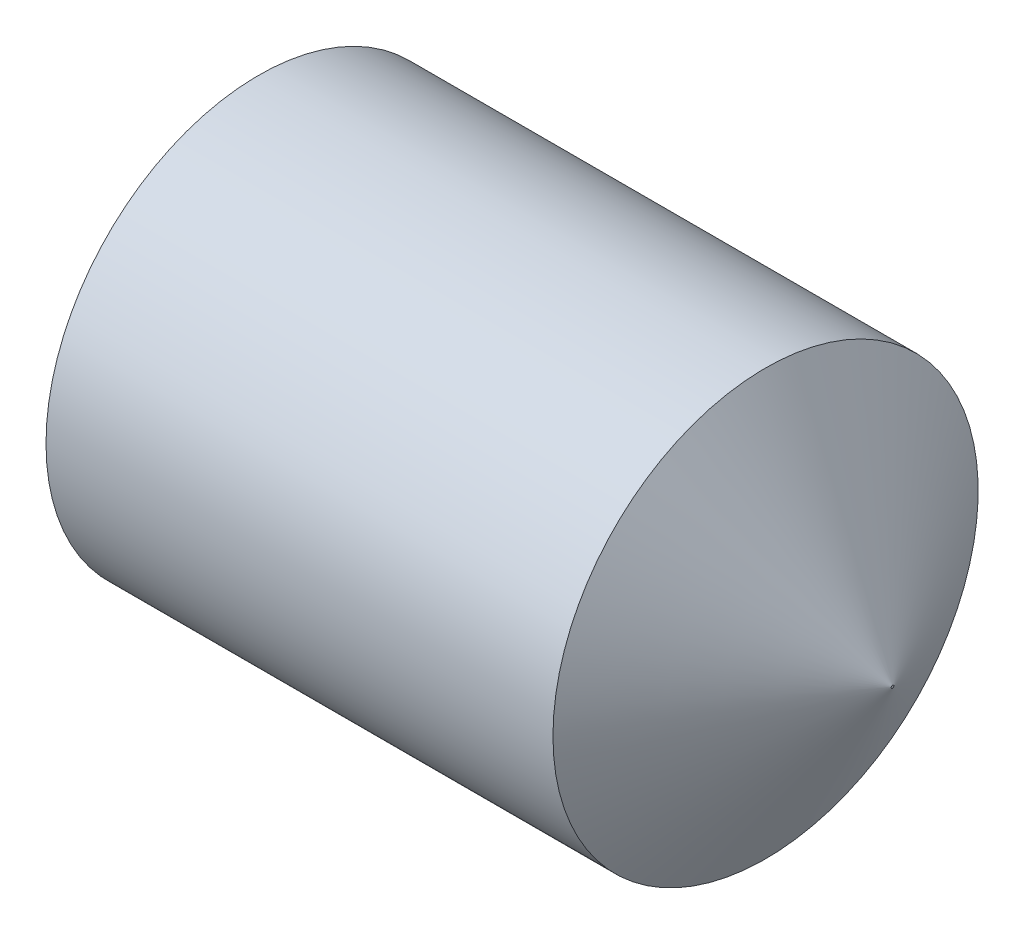
ISO-10303-21;
HEADER;
FILE_DESCRIPTION(('STEP AP214'),'2;1');
FILE_NAME('part.step','',(''),(''),'','','');
FILE_SCHEMA(('AUTOMOTIVE_DESIGN { 1 0 10303 214 1 1 1 1 }'));
ENDSEC;
DATA;
#1=APPLICATION_CONTEXT('core data for automotive mechanical design processes');
#2=APPLICATION_PROTOCOL_DEFINITION('international standard','automotive_design',2000,#1);
#3=PRODUCT_CONTEXT('',#1,'mechanical');
#4=PRODUCT('Part','Part','',(#3));
#5=PRODUCT_RELATED_PRODUCT_CATEGORY('part','',(#4));
#6=PRODUCT_DEFINITION_FORMATION('','',#4);
#7=PRODUCT_DEFINITION_CONTEXT('part definition',#1,'design');
#8=PRODUCT_DEFINITION('design','',#6,#7);
#9=PRODUCT_DEFINITION_SHAPE('','',#8);
#10=(LENGTH_UNIT() NAMED_UNIT(*) SI_UNIT(.MILLI.,.METRE.));
#11=(NAMED_UNIT(*) PLANE_ANGLE_UNIT() SI_UNIT($,.RADIAN.));
#12=(NAMED_UNIT(*) SI_UNIT($,.STERADIAN.) SOLID_ANGLE_UNIT());
#13=UNCERTAINTY_MEASURE_WITH_UNIT(LENGTH_MEASURE(1.E-05),#10,'distance_accuracy_value','');
#14=(GEOMETRIC_REPRESENTATION_CONTEXT(3) GLOBAL_UNCERTAINTY_ASSIGNED_CONTEXT((#13)) GLOBAL_UNIT_ASSIGNED_CONTEXT((#10,
#11,#12)) REPRESENTATION_CONTEXT('',''));
#15=CARTESIAN_POINT('',(0.,0.,0.));
#16=DIRECTION('',(0.,0.,1.));
#17=DIRECTION('',(1.,0.,0.));
#18=AXIS2_PLACEMENT_3D('',#15,#16,#17);
#19=CARTESIAN_POINT('',(0.,0.,0.));
#20=DIRECTION('',(-1.,0.,0.));
#21=DIRECTION('',(0.,0.,1.));
#22=AXIS2_PLACEMENT_3D('',#19,#20,#21);
#23=PLANE('',#22);
#24=CARTESIAN_POINT('',(0.,0.,0.));
#25=DIRECTION('',(-1.,0.,0.));
#26=DIRECTION('',(0.,0.,1.));
#27=AXIS2_PLACEMENT_3D('',#24,#25,#26);
#28=CIRCLE('',#27,0.601000000000001);
#29=CARTESIAN_POINT('',(0.,0.,0.601000000000001));
#30=VERTEX_POINT('',#29);
#31=EDGE_CURVE('E11',#30,#30,#28,.T.);
#32=ORIENTED_EDGE('',*,*,#31,.T.);
#33=EDGE_LOOP('',(#32));
#34=FACE_BOUND('',#33,.T.);
#35=DIRECTION('',(0.,0.,-1.));
#36=VECTOR('',#35,1.);
#37=CARTESIAN_POINT('',(0.,0.350000000000003,0.202072594216366));
#38=LINE('',#37,#36);
#39=CARTESIAN_POINT('',(0.,0.350000000000003,0.202072594216366));
#40=VERTEX_POINT('',#39);
#41=CARTESIAN_POINT('',(0.,0.350000000000003,-0.202072594216372));
#42=VERTEX_POINT('',#41);
#43=EDGE_CURVE('E125',#40,#42,#38,.T.);
#44=ORIENTED_EDGE('',*,*,#43,.F.);
#45=DIRECTION('',(0.,-0.866025403784439,0.5));
#46=VECTOR('',#45,1.);
#47=CARTESIAN_POINT('',(0.,0.350000000000003,0.202072594216366));
#48=LINE('',#47,#46);
#49=CARTESIAN_POINT('',(0.,0.,0.404145188432735));
#50=VERTEX_POINT('',#49);
#51=EDGE_CURVE('E47',#40,#50,#48,.T.);
#52=ORIENTED_EDGE('',*,*,#51,.T.);
#53=DIRECTION('',(0.,0.866025403784439,0.5));
#54=VECTOR('',#53,1.);
#55=CARTESIAN_POINT('',(0.,-0.349999999999997,0.202072594216366));
#56=LINE('',#55,#54);
#57=CARTESIAN_POINT('',(0.,-0.349999999999997,0.202072594216366));
#58=VERTEX_POINT('',#57);
#59=EDGE_CURVE('E116',#58,#50,#56,.T.);
#60=ORIENTED_EDGE('',*,*,#59,.F.);
#61=DIRECTION('',(0.,0.,-1.));
#62=VECTOR('',#61,1.);
#63=CARTESIAN_POINT('',(0.,-0.349999999999997,0.202072594216366));
#64=LINE('',#63,#62);
#65=CARTESIAN_POINT('',(0.,-0.349999999999997,-0.202072594216372));
#66=VERTEX_POINT('',#65);
#67=EDGE_CURVE('E119',#58,#66,#64,.T.);
#68=ORIENTED_EDGE('',*,*,#67,.T.);
#69=DIRECTION('',(0.,0.866025403784439,-0.5));
#70=VECTOR('',#69,1.);
#71=CARTESIAN_POINT('',(0.,-0.349999999999997,-0.202072594216372));
#72=LINE('',#71,#70);
#73=CARTESIAN_POINT('',(0.,0.,-0.404145188432741));
#74=VERTEX_POINT('',#73);
#75=EDGE_CURVE('E122',#66,#74,#72,.T.);
#76=ORIENTED_EDGE('',*,*,#75,.T.);
#77=DIRECTION('',(0.,-0.866025403784439,-0.5));
#78=VECTOR('',#77,1.);
#79=CARTESIAN_POINT('',(0.,0.350000000000003,-0.202072594216372));
#80=LINE('',#79,#78);
#81=EDGE_CURVE('E105',#42,#74,#80,.T.);
#82=ORIENTED_EDGE('',*,*,#81,.F.);
#83=EDGE_LOOP('',(#44,#52,#60,#68,#76,#82));
#84=FACE_BOUND('',#83,.T.);
#85=ADVANCED_FACE('F33',(#34,#84),#23,.T.);
#86=CARTESIAN_POINT('',(0.,0.,0.));
#87=DIRECTION('',(1.,0.,0.));
#88=DIRECTION('',(0.,0.,-1.));
#89=AXIS2_PLACEMENT_3D('',#86,#87,#88);
#90=CONICAL_SURFACE('',#89,0.601000000000001,1.0471975511966);
#91=CARTESIAN_POINT('',(0.114892703568735,0.,0.));
#92=DIRECTION('',(-1.,0.,0.));
#93=DIRECTION('',(0.,0.,1.));
#94=AXIS2_PLACEMENT_3D('',#91,#92,#93);
#95=CIRCLE('',#94,0.8);
#96=CARTESIAN_POINT('',(0.114892703568735,0.,0.8));
#97=VERTEX_POINT('',#96);
#98=EDGE_CURVE('E40',#97,#97,#95,.T.);
#99=ORIENTED_EDGE('',*,*,#98,.T.);
#100=EDGE_LOOP('',(#99));
#101=FACE_BOUND('',#100,.T.);
#102=ORIENTED_EDGE('',*,*,#31,.F.);
#103=EDGE_LOOP('',(#102));
#104=FACE_BOUND('',#103,.T.);
#105=ADVANCED_FACE('F142',(#101,#104),#90,.T.);
#106=CARTESIAN_POINT('',(-12.7,0.,0.));
#107=DIRECTION('',(-1.,0.,0.));
#108=DIRECTION('',(0.,0.,1.));
#109=AXIS2_PLACEMENT_3D('',#106,#107,#108);
#110=CYLINDRICAL_SURFACE('',#109,0.8);
#111=CARTESIAN_POINT('',(2.02231580787309,0.,0.));
#112=DIRECTION('',(-1.,0.,0.));
#113=DIRECTION('',(0.,0.,1.));
#114=AXIS2_PLACEMENT_3D('',#111,#112,#113);
#115=CIRCLE('',#114,0.8);
#116=CARTESIAN_POINT('',(2.02231580787309,0.,0.8));
#117=VERTEX_POINT('',#116);
#118=EDGE_CURVE('E137',#117,#117,#115,.T.);
#119=ORIENTED_EDGE('',*,*,#118,.T.);
#120=EDGE_LOOP('',(#119));
#121=FACE_BOUND('',#120,.T.);
#122=ORIENTED_EDGE('',*,*,#98,.F.);
#123=EDGE_LOOP('',(#122));
#124=FACE_BOUND('',#123,.T.);
#125=ADVANCED_FACE('F145',(#121,#124),#110,.T.);
#126=CARTESIAN_POINT('',(2.5,0.,0.));
#127=DIRECTION('',(-1.,0.,0.));
#128=DIRECTION('',(0.,0.,1.));
#129=AXIS2_PLACEMENT_3D('',#126,#127,#128);
#130=CONICAL_SURFACE('',#129,0.005,1.02974425867666);
#131=ORIENTED_EDGE('',*,*,#118,.F.);
#132=EDGE_LOOP('',(#131));
#133=FACE_BOUND('',#132,.T.);
#134=CARTESIAN_POINT('',(2.5,0.,0.));
#135=DIRECTION('',(-1.,0.,0.));
#136=DIRECTION('',(0.,0.,1.));
#137=AXIS2_PLACEMENT_3D('',#134,#135,#136);
#138=CIRCLE('',#137,0.005);
#139=CARTESIAN_POINT('',(2.5,0.,0.005));
#140=VERTEX_POINT('',#139);
#141=EDGE_CURVE('E134',#140,#140,#138,.T.);
#142=ORIENTED_EDGE('',*,*,#141,.T.);
#143=EDGE_LOOP('',(#142));
#144=FACE_BOUND('',#143,.T.);
#145=ADVANCED_FACE('F147',(#133,#144),#130,.T.);
#146=CARTESIAN_POINT('',(2.5,0.,0.));
#147=DIRECTION('',(-1.,0.,0.));
#148=DIRECTION('',(0.,0.,1.));
#149=AXIS2_PLACEMENT_3D('',#146,#147,#148);
#150=PLANE('',#149);
#151=ORIENTED_EDGE('',*,*,#141,.F.);
#152=EDGE_LOOP('',(#151));
#153=FACE_BOUND('',#152,.T.);
#154=ADVANCED_FACE('F154',(#153),#150,.F.);
#155=CARTESIAN_POINT('',(1.,0.350000000000003,0.202072594216366));
#156=DIRECTION('',(0.,-0.5,-0.866025403784439));
#157=DIRECTION('',(0.,0.866025403784439,-0.5));
#158=AXIS2_PLACEMENT_3D('',#155,#156,#157);
#159=PLANE('',#158);
#160=ORIENTED_EDGE('',*,*,#51,.F.);
#161=DIRECTION('',(-1.,0.,0.));
#162=VECTOR('',#161,1.);
#163=CARTESIAN_POINT('',(1.,0.350000000000003,0.202072594216366));
#164=LINE('',#163,#162);
#165=CARTESIAN_POINT('',(1.,0.350000000000003,0.202072594216366));
#166=VERTEX_POINT('',#165);
#167=EDGE_CURVE('E52',#166,#40,#164,.T.);
#168=ORIENTED_EDGE('',*,*,#167,.F.);
#169=DIRECTION('',(0.,-0.866025403784439,0.5));
#170=VECTOR('',#169,1.);
#171=CARTESIAN_POINT('',(1.,0.350000000000003,0.202072594216366));
#172=LINE('',#171,#170);
#173=CARTESIAN_POINT('',(1.,0.,0.404145188432735));
#174=VERTEX_POINT('',#173);
#175=EDGE_CURVE('E79',#166,#174,#172,.T.);
#176=ORIENTED_EDGE('',*,*,#175,.T.);
#177=DIRECTION('',(-1.,0.,0.));
#178=VECTOR('',#177,1.);
#179=CARTESIAN_POINT('',(1.,0.,0.404145188432735));
#180=LINE('',#179,#178);
#181=EDGE_CURVE('E132',#174,#50,#180,.T.);
#182=ORIENTED_EDGE('',*,*,#181,.T.);
#183=EDGE_LOOP('',(#160,#168,#176,#182));
#184=FACE_BOUND('',#183,.T.);
#185=ADVANCED_FACE('F185',(#184),#159,.T.);
#186=CARTESIAN_POINT('',(1.,-0.349999999999997,0.202072594216366));
#187=DIRECTION('',(0.,-0.5,0.866025403784439));
#188=DIRECTION('',(0.,-0.866025403784439,-0.5));
#189=AXIS2_PLACEMENT_3D('',#186,#187,#188);
#190=PLANE('',#189);
#191=ORIENTED_EDGE('',*,*,#59,.T.);
#192=ORIENTED_EDGE('',*,*,#181,.F.);
#193=DIRECTION('',(0.,0.866025403784439,0.5));
#194=VECTOR('',#193,1.);
#195=CARTESIAN_POINT('',(1.,-0.349999999999997,0.202072594216366));
#196=LINE('',#195,#194);
#197=CARTESIAN_POINT('',(1.,-0.349999999999997,0.202072594216366));
#198=VERTEX_POINT('',#197);
#199=EDGE_CURVE('E262',#198,#174,#196,.T.);
#200=ORIENTED_EDGE('',*,*,#199,.F.);
#201=DIRECTION('',(-1.,0.,0.));
#202=VECTOR('',#201,1.);
#203=CARTESIAN_POINT('',(1.,-0.349999999999997,0.202072594216366));
#204=LINE('',#203,#202);
#205=EDGE_CURVE('E130',#198,#58,#204,.T.);
#206=ORIENTED_EDGE('',*,*,#205,.T.);
#207=EDGE_LOOP('',(#191,#192,#200,#206));
#208=FACE_BOUND('',#207,.T.);
#209=ADVANCED_FACE('F181',(#208),#190,.F.);
#210=CARTESIAN_POINT('',(1.,-0.349999999999997,0.202072594216366));
#211=DIRECTION('',(0.,1.,0.));
#212=DIRECTION('',(0.,0.,1.));
#213=AXIS2_PLACEMENT_3D('',#210,#211,#212);
#214=PLANE('',#213);
#215=ORIENTED_EDGE('',*,*,#67,.F.);
#216=ORIENTED_EDGE('',*,*,#205,.F.);
#217=DIRECTION('',(0.,0.,-1.));
#218=VECTOR('',#217,1.);
#219=CARTESIAN_POINT('',(1.,-0.349999999999997,0.202072594216366));
#220=LINE('',#219,#218);
#221=CARTESIAN_POINT('',(1.,-0.349999999999997,-0.202072594216372));
#222=VERTEX_POINT('',#221);
#223=EDGE_CURVE('E100',#198,#222,#220,.T.);
#224=ORIENTED_EDGE('',*,*,#223,.T.);
#225=DIRECTION('',(-1.,0.,0.));
#226=VECTOR('',#225,1.);
#227=CARTESIAN_POINT('',(1.,-0.349999999999997,-0.202072594216372));
#228=LINE('',#227,#226);
#229=EDGE_CURVE('E95',#222,#66,#228,.T.);
#230=ORIENTED_EDGE('',*,*,#229,.T.);
#231=EDGE_LOOP('',(#215,#216,#224,#230));
#232=FACE_BOUND('',#231,.T.);
#233=ADVANCED_FACE('F178',(#232),#214,.T.);
#234=CARTESIAN_POINT('',(1.,-0.349999999999997,-0.202072594216372));
#235=DIRECTION('',(0.,0.5,0.866025403784439));
#236=DIRECTION('',(0.,-0.866025403784439,0.5));
#237=AXIS2_PLACEMENT_3D('',#234,#235,#236);
#238=PLANE('',#237);
#239=ORIENTED_EDGE('',*,*,#75,.F.);
#240=ORIENTED_EDGE('',*,*,#229,.F.);
#241=DIRECTION('',(0.,0.866025403784439,-0.5));
#242=VECTOR('',#241,1.);
#243=CARTESIAN_POINT('',(1.,-0.349999999999997,-0.202072594216372));
#244=LINE('',#243,#242);
#245=CARTESIAN_POINT('',(1.,0.,-0.404145188432741));
#246=VERTEX_POINT('',#245);
#247=EDGE_CURVE('E90',#222,#246,#244,.T.);
#248=ORIENTED_EDGE('',*,*,#247,.T.);
#249=DIRECTION('',(-1.,0.,0.));
#250=VECTOR('',#249,1.);
#251=CARTESIAN_POINT('',(1.,0.,-0.404145188432741));
#252=LINE('',#251,#250);
#253=EDGE_CURVE('E94',#246,#74,#252,.T.);
#254=ORIENTED_EDGE('',*,*,#253,.T.);
#255=EDGE_LOOP('',(#239,#240,#248,#254));
#256=FACE_BOUND('',#255,.T.);
#257=ADVANCED_FACE('F93',(#256),#238,.T.);
#258=CARTESIAN_POINT('',(1.,0.350000000000003,-0.202072594216372));
#259=DIRECTION('',(0.,0.5,-0.866025403784439));
#260=DIRECTION('',(0.,0.866025403784439,0.5));
#261=AXIS2_PLACEMENT_3D('',#258,#259,#260);
#262=PLANE('',#261);
#263=ORIENTED_EDGE('',*,*,#81,.T.);
#264=ORIENTED_EDGE('',*,*,#253,.F.);
#265=DIRECTION('',(0.,-0.866025403784439,-0.5));
#266=VECTOR('',#265,1.);
#267=CARTESIAN_POINT('',(1.,0.350000000000003,-0.202072594216372));
#268=LINE('',#267,#266);
#269=CARTESIAN_POINT('',(1.,0.350000000000003,-0.202072594216372));
#270=VERTEX_POINT('',#269);
#271=EDGE_CURVE('E99',#270,#246,#268,.T.);
#272=ORIENTED_EDGE('',*,*,#271,.F.);
#273=DIRECTION('',(-1.,0.,0.));
#274=VECTOR('',#273,1.);
#275=CARTESIAN_POINT('',(1.,0.350000000000003,-0.202072594216372));
#276=LINE('',#275,#274);
#277=EDGE_CURVE('E75',#270,#42,#276,.T.);
#278=ORIENTED_EDGE('',*,*,#277,.T.);
#279=EDGE_LOOP('',(#263,#264,#272,#278));
#280=FACE_BOUND('',#279,.T.);
#281=ADVANCED_FACE('F102',(#280),#262,.F.);
#282=CARTESIAN_POINT('',(1.,0.350000000000003,0.202072594216366));
#283=DIRECTION('',(0.,1.,0.));
#284=DIRECTION('',(0.,0.,1.));
#285=AXIS2_PLACEMENT_3D('',#282,#283,#284);
#286=PLANE('',#285);
#287=ORIENTED_EDGE('',*,*,#43,.T.);
#288=ORIENTED_EDGE('',*,*,#277,.F.);
#289=DIRECTION('',(0.,0.,-1.));
#290=VECTOR('',#289,1.);
#291=CARTESIAN_POINT('',(1.,0.350000000000003,0.202072594216366));
#292=LINE('',#291,#290);
#293=EDGE_CURVE('E110',#166,#270,#292,.T.);
#294=ORIENTED_EDGE('',*,*,#293,.F.);
#295=ORIENTED_EDGE('',*,*,#167,.T.);
#296=EDGE_LOOP('',(#287,#288,#294,#295));
#297=FACE_BOUND('',#296,.T.);
#298=ADVANCED_FACE('F166',(#297),#286,.F.);
#299=CARTESIAN_POINT('',(1.,0.350000000000003,0.202072594216366));
#300=DIRECTION('',(1.,0.,0.));
#301=DIRECTION('',(0.,0.,-1.));
#302=AXIS2_PLACEMENT_3D('',#299,#300,#301);
#303=PLANE('',#302);
#304=ORIENTED_EDGE('',*,*,#175,.F.);
#305=ORIENTED_EDGE('',*,*,#293,.T.);
#306=ORIENTED_EDGE('',*,*,#271,.T.);
#307=ORIENTED_EDGE('',*,*,#247,.F.);
#308=ORIENTED_EDGE('',*,*,#223,.F.);
#309=ORIENTED_EDGE('',*,*,#199,.T.);
#310=EDGE_LOOP('',(#304,#305,#306,#307,#308,#309));
#311=FACE_BOUND('',#310,.T.);
#312=ADVANCED_FACE('F108',(#311),#303,.F.);
#313=CLOSED_SHELL('',(#85,#105,#125,#145,#154,#185,#209,#233,#257,#281,#298,#312));
#314=MANIFOLD_SOLID_BREP('B2',#313);
#315=ADVANCED_BREP_SHAPE_REPRESENTATION('',(#18,#314),#14);
#316=SHAPE_DEFINITION_REPRESENTATION(#9,#315);
ENDSEC;
END-ISO-10303-21;
